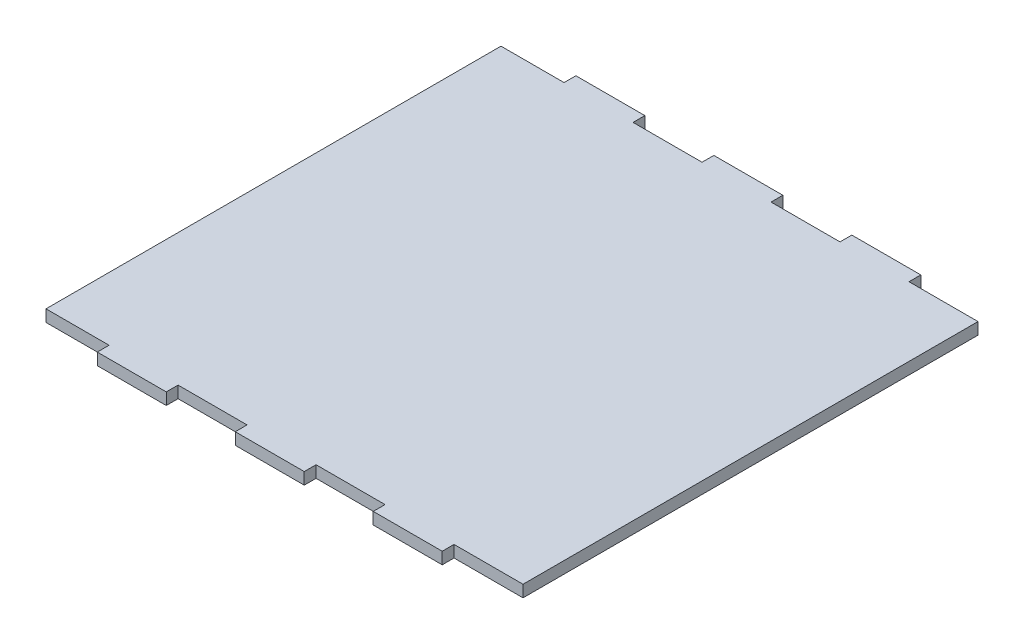
ISO-10303-21;
HEADER;
FILE_DESCRIPTION(('STEP AP214'),'2;1');
FILE_NAME('part.step','',(''),(''),'','','');
FILE_SCHEMA(('AUTOMOTIVE_DESIGN { 1 0 10303 214 1 1 1 1 }'));
ENDSEC;
DATA;
#1=APPLICATION_CONTEXT('core data for automotive mechanical design processes');
#2=APPLICATION_PROTOCOL_DEFINITION('international standard','automotive_design',2000,#1);
#3=PRODUCT_CONTEXT('',#1,'mechanical');
#4=PRODUCT('Part','Part','',(#3));
#5=PRODUCT_RELATED_PRODUCT_CATEGORY('part','',(#4));
#6=PRODUCT_DEFINITION_FORMATION('','',#4);
#7=PRODUCT_DEFINITION_CONTEXT('part definition',#1,'design');
#8=PRODUCT_DEFINITION('design','',#6,#7);
#9=PRODUCT_DEFINITION_SHAPE('','',#8);
#10=(LENGTH_UNIT() NAMED_UNIT(*) SI_UNIT(.MILLI.,.METRE.));
#11=(NAMED_UNIT(*) PLANE_ANGLE_UNIT() SI_UNIT($,.RADIAN.));
#12=(NAMED_UNIT(*) SI_UNIT($,.STERADIAN.) SOLID_ANGLE_UNIT());
#13=UNCERTAINTY_MEASURE_WITH_UNIT(LENGTH_MEASURE(1.E-05),#10,'distance_accuracy_value','');
#14=(GEOMETRIC_REPRESENTATION_CONTEXT(3) GLOBAL_UNCERTAINTY_ASSIGNED_CONTEXT((#13)) GLOBAL_UNIT_ASSIGNED_CONTEXT((#10,
#11,#12)) REPRESENTATION_CONTEXT('',''));
#15=CARTESIAN_POINT('',(0.,0.,0.));
#16=DIRECTION('',(0.,0.,1.));
#17=DIRECTION('',(1.,0.,0.));
#18=AXIS2_PLACEMENT_3D('',#15,#16,#17);
#19=CARTESIAN_POINT('',(0.,3.,0.));
#20=DIRECTION('',(0.,0.,-1.));
#21=DIRECTION('',(-1.,0.,0.));
#22=AXIS2_PLACEMENT_3D('',#19,#20,#21);
#23=PLANE('',#22);
#24=DIRECTION('',(1.,0.,0.));
#25=VECTOR('',#24,1.);
#26=CARTESIAN_POINT('',(0.,3.,0.));
#27=LINE('',#26,#25);
#28=CARTESIAN_POINT('',(1.5,3.,0.));
#29=VERTEX_POINT('',#28);
#30=CARTESIAN_POINT('',(17.52857143,3.,0.));
#31=VERTEX_POINT('',#30);
#32=EDGE_CURVE('E162',#29,#31,#27,.T.);
#33=ORIENTED_EDGE('',*,*,#32,.F.);
#34=DIRECTION('',(0.,-1.,0.));
#35=VECTOR('',#34,1.);
#36=CARTESIAN_POINT('',(1.5,3.,0.));
#37=LINE('',#36,#35);
#38=CARTESIAN_POINT('',(1.5,0.,0.));
#39=VERTEX_POINT('',#38);
#40=EDGE_CURVE('E266',#29,#39,#37,.T.);
#41=ORIENTED_EDGE('',*,*,#40,.T.);
#42=DIRECTION('',(1.,0.,0.));
#43=VECTOR('',#42,1.);
#44=CARTESIAN_POINT('',(0.,0.,0.));
#45=LINE('',#44,#43);
#46=CARTESIAN_POINT('',(17.52857143,0.,0.));
#47=VERTEX_POINT('',#46);
#48=EDGE_CURVE('E263',#39,#47,#45,.T.);
#49=ORIENTED_EDGE('',*,*,#48,.T.);
#50=DIRECTION('',(0.,-1.,0.));
#51=VECTOR('',#50,1.);
#52=CARTESIAN_POINT('',(17.52857143,3.,0.));
#53=LINE('',#52,#51);
#54=EDGE_CURVE('E11',#31,#47,#53,.T.);
#55=ORIENTED_EDGE('',*,*,#54,.F.);
#56=EDGE_LOOP('',(#33,#41,#49,#55));
#57=FACE_BOUND('',#56,.T.);
#58=ADVANCED_FACE('F44',(#57),#23,.F.);
#59=CARTESIAN_POINT('',(17.52857143,3.,0.));
#60=DIRECTION('',(1.,0.,0.));
#61=DIRECTION('',(0.,0.,-1.));
#62=AXIS2_PLACEMENT_3D('',#59,#60,#61);
#63=PLANE('',#62);
#64=DIRECTION('',(0.,0.,1.));
#65=VECTOR('',#64,1.);
#66=CARTESIAN_POINT('',(17.52857143,0.,0.));
#67=LINE('',#66,#65);
#68=CARTESIAN_POINT('',(17.52857143,0.,3.));
#69=VERTEX_POINT('',#68);
#70=EDGE_CURVE('E265',#47,#69,#67,.T.);
#71=ORIENTED_EDGE('',*,*,#70,.T.);
#72=DIRECTION('',(0.,-1.,0.));
#73=VECTOR('',#72,1.);
#74=CARTESIAN_POINT('',(17.52857143,3.,3.));
#75=LINE('',#74,#73);
#76=CARTESIAN_POINT('',(17.52857143,3.,3.));
#77=VERTEX_POINT('',#76);
#78=EDGE_CURVE('E51',#77,#69,#75,.T.);
#79=ORIENTED_EDGE('',*,*,#78,.F.);
#80=DIRECTION('',(0.,0.,1.));
#81=VECTOR('',#80,1.);
#82=CARTESIAN_POINT('',(17.52857143,3.,0.));
#83=LINE('',#82,#81);
#84=EDGE_CURVE('E473',#31,#77,#83,.T.);
#85=ORIENTED_EDGE('',*,*,#84,.F.);
#86=ORIENTED_EDGE('',*,*,#54,.T.);
#87=EDGE_LOOP('',(#71,#79,#85,#86));
#88=FACE_BOUND('',#87,.T.);
#89=ADVANCED_FACE('F474',(#88),#63,.F.);
#90=CARTESIAN_POINT('',(17.52857143,3.,3.));
#91=DIRECTION('',(0.,0.,-1.));
#92=DIRECTION('',(-1.,0.,0.));
#93=AXIS2_PLACEMENT_3D('',#90,#91,#92);
#94=PLANE('',#93);
#95=DIRECTION('',(1.,0.,0.));
#96=VECTOR('',#95,1.);
#97=CARTESIAN_POINT('',(17.52857143,0.,3.));
#98=LINE('',#97,#96);
#99=CARTESIAN_POINT('',(35.05714243,0.,3.));
#100=VERTEX_POINT('',#99);
#101=EDGE_CURVE('E268',#69,#100,#98,.T.);
#102=ORIENTED_EDGE('',*,*,#101,.T.);
#103=DIRECTION('',(0.,-1.,0.));
#104=VECTOR('',#103,1.);
#105=CARTESIAN_POINT('',(35.05714243,3.,3.));
#106=LINE('',#105,#104);
#107=CARTESIAN_POINT('',(35.05714243,3.,3.));
#108=VERTEX_POINT('',#107);
#109=EDGE_CURVE('E377',#108,#100,#106,.T.);
#110=ORIENTED_EDGE('',*,*,#109,.F.);
#111=DIRECTION('',(1.,0.,0.));
#112=VECTOR('',#111,1.);
#113=CARTESIAN_POINT('',(17.52857143,3.,3.));
#114=LINE('',#113,#112);
#115=EDGE_CURVE('E386',#77,#108,#114,.T.);
#116=ORIENTED_EDGE('',*,*,#115,.F.);
#117=ORIENTED_EDGE('',*,*,#78,.T.);
#118=EDGE_LOOP('',(#102,#110,#116,#117));
#119=FACE_BOUND('',#118,.T.);
#120=ADVANCED_FACE('F384',(#119),#94,.F.);
#121=CARTESIAN_POINT('',(35.05714243,3.,0.));
#122=DIRECTION('',(-1.,0.,0.));
#123=DIRECTION('',(0.,0.,1.));
#124=AXIS2_PLACEMENT_3D('',#121,#122,#123);
#125=PLANE('',#124);
#126=DIRECTION('',(0.,0.,-1.));
#127=VECTOR('',#126,1.);
#128=CARTESIAN_POINT('',(35.05714243,0.,0.));
#129=LINE('',#128,#127);
#130=CARTESIAN_POINT('',(35.05714243,0.,0.));
#131=VERTEX_POINT('',#130);
#132=EDGE_CURVE('E270',#100,#131,#129,.T.);
#133=ORIENTED_EDGE('',*,*,#132,.T.);
#134=DIRECTION('',(0.,-1.,0.));
#135=VECTOR('',#134,1.);
#136=CARTESIAN_POINT('',(35.05714243,3.,0.));
#137=LINE('',#136,#135);
#138=CARTESIAN_POINT('',(35.05714243,3.,0.));
#139=VERTEX_POINT('',#138);
#140=EDGE_CURVE('E374',#139,#131,#137,.T.);
#141=ORIENTED_EDGE('',*,*,#140,.F.);
#142=DIRECTION('',(0.,0.,-1.));
#143=VECTOR('',#142,1.);
#144=CARTESIAN_POINT('',(35.05714243,3.,0.));
#145=LINE('',#144,#143);
#146=EDGE_CURVE('E407',#108,#139,#145,.T.);
#147=ORIENTED_EDGE('',*,*,#146,.F.);
#148=ORIENTED_EDGE('',*,*,#109,.T.);
#149=EDGE_LOOP('',(#133,#141,#147,#148));
#150=FACE_BOUND('',#149,.T.);
#151=ADVANCED_FACE('F398',(#150),#125,.F.);
#152=CARTESIAN_POINT('',(35.05714243,3.,0.));
#153=DIRECTION('',(0.,0.,-1.));
#154=DIRECTION('',(-1.,0.,0.));
#155=AXIS2_PLACEMENT_3D('',#152,#153,#154);
#156=PLANE('',#155);
#157=DIRECTION('',(1.,0.,0.));
#158=VECTOR('',#157,1.);
#159=CARTESIAN_POINT('',(35.05714243,0.,0.));
#160=LINE('',#159,#158);
#161=CARTESIAN_POINT('',(52.58571343,0.,0.));
#162=VERTEX_POINT('',#161);
#163=EDGE_CURVE('E272',#131,#162,#160,.T.);
#164=ORIENTED_EDGE('',*,*,#163,.T.);
#165=DIRECTION('',(0.,-1.,0.));
#166=VECTOR('',#165,1.);
#167=CARTESIAN_POINT('',(52.58571343,3.,0.));
#168=LINE('',#167,#166);
#169=CARTESIAN_POINT('',(52.58571343,3.,0.));
#170=VERTEX_POINT('',#169);
#171=EDGE_CURVE('E371',#170,#162,#168,.T.);
#172=ORIENTED_EDGE('',*,*,#171,.F.);
#173=DIRECTION('',(1.,0.,0.));
#174=VECTOR('',#173,1.);
#175=CARTESIAN_POINT('',(35.05714243,3.,0.));
#176=LINE('',#175,#174);
#177=EDGE_CURVE('E404',#139,#170,#176,.T.);
#178=ORIENTED_EDGE('',*,*,#177,.F.);
#179=ORIENTED_EDGE('',*,*,#140,.T.);
#180=EDGE_LOOP('',(#164,#172,#178,#179));
#181=FACE_BOUND('',#180,.T.);
#182=ADVANCED_FACE('F402',(#181),#156,.F.);
#183=CARTESIAN_POINT('',(52.58571343,3.,0.));
#184=DIRECTION('',(1.,0.,0.));
#185=DIRECTION('',(0.,0.,-1.));
#186=AXIS2_PLACEMENT_3D('',#183,#184,#185);
#187=PLANE('',#186);
#188=DIRECTION('',(0.,0.,1.));
#189=VECTOR('',#188,1.);
#190=CARTESIAN_POINT('',(52.58571343,0.,0.));
#191=LINE('',#190,#189);
#192=CARTESIAN_POINT('',(52.58571343,0.,3.));
#193=VERTEX_POINT('',#192);
#194=EDGE_CURVE('E274',#162,#193,#191,.T.);
#195=ORIENTED_EDGE('',*,*,#194,.T.);
#196=DIRECTION('',(0.,-1.,0.));
#197=VECTOR('',#196,1.);
#198=CARTESIAN_POINT('',(52.58571343,3.,3.));
#199=LINE('',#198,#197);
#200=CARTESIAN_POINT('',(52.58571343,3.,3.));
#201=VERTEX_POINT('',#200);
#202=EDGE_CURVE('E368',#201,#193,#199,.T.);
#203=ORIENTED_EDGE('',*,*,#202,.F.);
#204=DIRECTION('',(0.,0.,1.));
#205=VECTOR('',#204,1.);
#206=CARTESIAN_POINT('',(52.58571343,3.,0.));
#207=LINE('',#206,#205);
#208=EDGE_CURVE('E406',#170,#201,#207,.T.);
#209=ORIENTED_EDGE('',*,*,#208,.F.);
#210=ORIENTED_EDGE('',*,*,#171,.T.);
#211=EDGE_LOOP('',(#195,#203,#209,#210));
#212=FACE_BOUND('',#211,.T.);
#213=ADVANCED_FACE('F486',(#212),#187,.F.);
#214=CARTESIAN_POINT('',(52.58571343,3.,3.));
#215=DIRECTION('',(0.,0.,-1.));
#216=DIRECTION('',(-1.,0.,0.));
#217=AXIS2_PLACEMENT_3D('',#214,#215,#216);
#218=PLANE('',#217);
#219=DIRECTION('',(1.,0.,0.));
#220=VECTOR('',#219,1.);
#221=CARTESIAN_POINT('',(52.58571343,0.,3.));
#222=LINE('',#221,#220);
#223=CARTESIAN_POINT('',(70.11428443,0.,3.));
#224=VERTEX_POINT('',#223);
#225=EDGE_CURVE('E276',#193,#224,#222,.T.);
#226=ORIENTED_EDGE('',*,*,#225,.T.);
#227=DIRECTION('',(0.,-1.,0.));
#228=VECTOR('',#227,1.);
#229=CARTESIAN_POINT('',(70.11428443,3.,3.));
#230=LINE('',#229,#228);
#231=CARTESIAN_POINT('',(70.11428443,3.,3.));
#232=VERTEX_POINT('',#231);
#233=EDGE_CURVE('E365',#232,#224,#230,.T.);
#234=ORIENTED_EDGE('',*,*,#233,.F.);
#235=DIRECTION('',(1.,0.,0.));
#236=VECTOR('',#235,1.);
#237=CARTESIAN_POINT('',(52.58571343,3.,3.));
#238=LINE('',#237,#236);
#239=EDGE_CURVE('E409',#201,#232,#238,.T.);
#240=ORIENTED_EDGE('',*,*,#239,.F.);
#241=ORIENTED_EDGE('',*,*,#202,.T.);
#242=EDGE_LOOP('',(#226,#234,#240,#241));
#243=FACE_BOUND('',#242,.T.);
#244=ADVANCED_FACE('F489',(#243),#218,.F.);
#245=CARTESIAN_POINT('',(70.11428443,3.,0.));
#246=DIRECTION('',(-1.,0.,0.));
#247=DIRECTION('',(0.,0.,1.));
#248=AXIS2_PLACEMENT_3D('',#245,#246,#247);
#249=PLANE('',#248);
#250=DIRECTION('',(0.,0.,-1.));
#251=VECTOR('',#250,1.);
#252=CARTESIAN_POINT('',(70.11428443,0.,0.));
#253=LINE('',#252,#251);
#254=CARTESIAN_POINT('',(70.11428443,0.,0.));
#255=VERTEX_POINT('',#254);
#256=EDGE_CURVE('E278',#224,#255,#253,.T.);
#257=ORIENTED_EDGE('',*,*,#256,.T.);
#258=DIRECTION('',(0.,-1.,0.));
#259=VECTOR('',#258,1.);
#260=CARTESIAN_POINT('',(70.11428443,3.,0.));
#261=LINE('',#260,#259);
#262=CARTESIAN_POINT('',(70.11428443,3.,0.));
#263=VERTEX_POINT('',#262);
#264=EDGE_CURVE('E362',#263,#255,#261,.T.);
#265=ORIENTED_EDGE('',*,*,#264,.F.);
#266=DIRECTION('',(0.,0.,-1.));
#267=VECTOR('',#266,1.);
#268=CARTESIAN_POINT('',(70.11428443,3.,0.));
#269=LINE('',#268,#267);
#270=EDGE_CURVE('E415',#232,#263,#269,.T.);
#271=ORIENTED_EDGE('',*,*,#270,.F.);
#272=ORIENTED_EDGE('',*,*,#233,.T.);
#273=EDGE_LOOP('',(#257,#265,#271,#272));
#274=FACE_BOUND('',#273,.T.);
#275=ADVANCED_FACE('F493',(#274),#249,.F.);
#276=CARTESIAN_POINT('',(70.11428443,3.,0.));
#277=DIRECTION('',(0.,0.,-1.));
#278=DIRECTION('',(-1.,0.,0.));
#279=AXIS2_PLACEMENT_3D('',#276,#277,#278);
#280=PLANE('',#279);
#281=DIRECTION('',(1.,0.,0.));
#282=VECTOR('',#281,1.);
#283=CARTESIAN_POINT('',(70.11428443,0.,0.));
#284=LINE('',#283,#282);
#285=CARTESIAN_POINT('',(87.64285543,0.,0.));
#286=VERTEX_POINT('',#285);
#287=EDGE_CURVE('E280',#255,#286,#284,.T.);
#288=ORIENTED_EDGE('',*,*,#287,.T.);
#289=DIRECTION('',(0.,-1.,0.));
#290=VECTOR('',#289,1.);
#291=CARTESIAN_POINT('',(87.64285543,3.,0.));
#292=LINE('',#291,#290);
#293=CARTESIAN_POINT('',(87.64285543,3.,0.));
#294=VERTEX_POINT('',#293);
#295=EDGE_CURVE('E359',#294,#286,#292,.T.);
#296=ORIENTED_EDGE('',*,*,#295,.F.);
#297=DIRECTION('',(1.,0.,0.));
#298=VECTOR('',#297,1.);
#299=CARTESIAN_POINT('',(70.11428443,3.,0.));
#300=LINE('',#299,#298);
#301=EDGE_CURVE('E417',#263,#294,#300,.T.);
#302=ORIENTED_EDGE('',*,*,#301,.F.);
#303=ORIENTED_EDGE('',*,*,#264,.T.);
#304=EDGE_LOOP('',(#288,#296,#302,#303));
#305=FACE_BOUND('',#304,.T.);
#306=ADVANCED_FACE('F497',(#305),#280,.F.);
#307=CARTESIAN_POINT('',(87.64285543,3.,0.));
#308=DIRECTION('',(1.,0.,0.));
#309=DIRECTION('',(0.,0.,-1.));
#310=AXIS2_PLACEMENT_3D('',#307,#308,#309);
#311=PLANE('',#310);
#312=DIRECTION('',(0.,0.,1.));
#313=VECTOR('',#312,1.);
#314=CARTESIAN_POINT('',(87.64285543,0.,0.));
#315=LINE('',#314,#313);
#316=CARTESIAN_POINT('',(87.64285543,0.,3.));
#317=VERTEX_POINT('',#316);
#318=EDGE_CURVE('E282',#286,#317,#315,.T.);
#319=ORIENTED_EDGE('',*,*,#318,.T.);
#320=DIRECTION('',(0.,-1.,0.));
#321=VECTOR('',#320,1.);
#322=CARTESIAN_POINT('',(87.64285543,3.,3.));
#323=LINE('',#322,#321);
#324=CARTESIAN_POINT('',(87.64285543,3.,3.));
#325=VERTEX_POINT('',#324);
#326=EDGE_CURVE('E356',#325,#317,#323,.T.);
#327=ORIENTED_EDGE('',*,*,#326,.F.);
#328=DIRECTION('',(0.,0.,1.));
#329=VECTOR('',#328,1.);
#330=CARTESIAN_POINT('',(87.64285543,3.,0.));
#331=LINE('',#330,#329);
#332=EDGE_CURVE('E419',#294,#325,#331,.T.);
#333=ORIENTED_EDGE('',*,*,#332,.F.);
#334=ORIENTED_EDGE('',*,*,#295,.T.);
#335=EDGE_LOOP('',(#319,#327,#333,#334));
#336=FACE_BOUND('',#335,.T.);
#337=ADVANCED_FACE('F501',(#336),#311,.F.);
#338=CARTESIAN_POINT('',(87.64285543,3.,3.));
#339=DIRECTION('',(0.,0.,-1.));
#340=DIRECTION('',(-1.,0.,0.));
#341=AXIS2_PLACEMENT_3D('',#338,#339,#340);
#342=PLANE('',#341);
#343=DIRECTION('',(1.,0.,0.));
#344=VECTOR('',#343,1.);
#345=CARTESIAN_POINT('',(87.64285543,0.,3.));
#346=LINE('',#345,#344);
#347=CARTESIAN_POINT('',(105.17142643,0.,3.));
#348=VERTEX_POINT('',#347);
#349=EDGE_CURVE('E284',#317,#348,#346,.T.);
#350=ORIENTED_EDGE('',*,*,#349,.T.);
#351=DIRECTION('',(0.,-1.,0.));
#352=VECTOR('',#351,1.);
#353=CARTESIAN_POINT('',(105.17142643,3.,3.));
#354=LINE('',#353,#352);
#355=CARTESIAN_POINT('',(105.17142643,3.,3.));
#356=VERTEX_POINT('',#355);
#357=EDGE_CURVE('E353',#356,#348,#354,.T.);
#358=ORIENTED_EDGE('',*,*,#357,.F.);
#359=DIRECTION('',(1.,0.,0.));
#360=VECTOR('',#359,1.);
#361=CARTESIAN_POINT('',(87.64285543,3.,3.));
#362=LINE('',#361,#360);
#363=EDGE_CURVE('E421',#325,#356,#362,.T.);
#364=ORIENTED_EDGE('',*,*,#363,.F.);
#365=ORIENTED_EDGE('',*,*,#326,.T.);
#366=EDGE_LOOP('',(#350,#358,#364,#365));
#367=FACE_BOUND('',#366,.T.);
#368=ADVANCED_FACE('F505',(#367),#342,.F.);
#369=CARTESIAN_POINT('',(105.17142643,3.,0.));
#370=DIRECTION('',(-1.,0.,0.));
#371=DIRECTION('',(0.,0.,1.));
#372=AXIS2_PLACEMENT_3D('',#369,#370,#371);
#373=PLANE('',#372);
#374=DIRECTION('',(0.,0.,-1.));
#375=VECTOR('',#374,1.);
#376=CARTESIAN_POINT('',(105.17142643,0.,0.));
#377=LINE('',#376,#375);
#378=CARTESIAN_POINT('',(105.17142643,0.,0.));
#379=VERTEX_POINT('',#378);
#380=EDGE_CURVE('E286',#348,#379,#377,.T.);
#381=ORIENTED_EDGE('',*,*,#380,.T.);
#382=DIRECTION('',(0.,-1.,0.));
#383=VECTOR('',#382,1.);
#384=CARTESIAN_POINT('',(105.17142643,3.,0.));
#385=LINE('',#384,#383);
#386=CARTESIAN_POINT('',(105.17142643,3.,0.));
#387=VERTEX_POINT('',#386);
#388=EDGE_CURVE('E350',#387,#379,#385,.T.);
#389=ORIENTED_EDGE('',*,*,#388,.F.);
#390=DIRECTION('',(0.,0.,-1.));
#391=VECTOR('',#390,1.);
#392=CARTESIAN_POINT('',(105.17142643,3.,0.));
#393=LINE('',#392,#391);
#394=EDGE_CURVE('E423',#356,#387,#393,.T.);
#395=ORIENTED_EDGE('',*,*,#394,.F.);
#396=ORIENTED_EDGE('',*,*,#357,.T.);
#397=EDGE_LOOP('',(#381,#389,#395,#396));
#398=FACE_BOUND('',#397,.T.);
#399=ADVANCED_FACE('F509',(#398),#373,.F.);
#400=CARTESIAN_POINT('',(105.17142643,3.,0.));
#401=DIRECTION('',(0.,0.,-1.));
#402=DIRECTION('',(-1.,0.,0.));
#403=AXIS2_PLACEMENT_3D('',#400,#401,#402);
#404=PLANE('',#403);
#405=DIRECTION('',(1.,0.,0.));
#406=VECTOR('',#405,1.);
#407=CARTESIAN_POINT('',(105.17142643,0.,0.));
#408=LINE('',#407,#406);
#409=CARTESIAN_POINT('',(122.7,0.,0.));
#410=VERTEX_POINT('',#409);
#411=EDGE_CURVE('E288',#379,#410,#408,.T.);
#412=ORIENTED_EDGE('',*,*,#411,.T.);
#413=DIRECTION('',(0.,-1.,0.));
#414=VECTOR('',#413,1.);
#415=CARTESIAN_POINT('',(122.7,3.,0.));
#416=LINE('',#415,#414);
#417=CARTESIAN_POINT('',(122.7,3.,0.));
#418=VERTEX_POINT('',#417);
#419=EDGE_CURVE('E347',#418,#410,#416,.T.);
#420=ORIENTED_EDGE('',*,*,#419,.F.);
#421=DIRECTION('',(1.,0.,0.));
#422=VECTOR('',#421,1.);
#423=CARTESIAN_POINT('',(105.17142643,3.,0.));
#424=LINE('',#423,#422);
#425=EDGE_CURVE('E425',#387,#418,#424,.T.);
#426=ORIENTED_EDGE('',*,*,#425,.F.);
#427=ORIENTED_EDGE('',*,*,#388,.T.);
#428=EDGE_LOOP('',(#412,#420,#426,#427));
#429=FACE_BOUND('',#428,.T.);
#430=ADVANCED_FACE('F513',(#429),#404,.F.);
#431=CARTESIAN_POINT('',(122.7,3.,0.));
#432=DIRECTION('',(-1.,0.,0.));
#433=DIRECTION('',(0.,0.,1.));
#434=AXIS2_PLACEMENT_3D('',#431,#432,#433);
#435=PLANE('',#434);
#436=DIRECTION('',(0.,0.,-1.));
#437=VECTOR('',#436,1.);
#438=CARTESIAN_POINT('',(122.7,0.,0.));
#439=LINE('',#438,#437);
#440=CARTESIAN_POINT('',(122.7,0.,-115.6));
#441=VERTEX_POINT('',#440);
#442=EDGE_CURVE('E290',#410,#441,#439,.T.);
#443=ORIENTED_EDGE('',*,*,#442,.T.);
#444=DIRECTION('',(0.,-1.,0.));
#445=VECTOR('',#444,1.);
#446=CARTESIAN_POINT('',(122.7,3.,-115.6));
#447=LINE('',#446,#445);
#448=CARTESIAN_POINT('',(122.7,3.,-115.6));
#449=VERTEX_POINT('',#448);
#450=EDGE_CURVE('E344',#449,#441,#447,.T.);
#451=ORIENTED_EDGE('',*,*,#450,.F.);
#452=DIRECTION('',(0.,0.,-1.));
#453=VECTOR('',#452,1.);
#454=CARTESIAN_POINT('',(122.7,3.,0.));
#455=LINE('',#454,#453);
#456=EDGE_CURVE('E427',#418,#449,#455,.T.);
#457=ORIENTED_EDGE('',*,*,#456,.F.);
#458=ORIENTED_EDGE('',*,*,#419,.T.);
#459=EDGE_LOOP('',(#443,#451,#457,#458));
#460=FACE_BOUND('',#459,.T.);
#461=ADVANCED_FACE('F517',(#460),#435,.F.);
#462=CARTESIAN_POINT('',(105.17142643,3.,-115.6));
#463=DIRECTION('',(0.,0.,1.));
#464=DIRECTION('',(1.,0.,0.));
#465=AXIS2_PLACEMENT_3D('',#462,#463,#464);
#466=PLANE('',#465);
#467=DIRECTION('',(-1.,0.,0.));
#468=VECTOR('',#467,1.);
#469=CARTESIAN_POINT('',(105.17142643,0.,-115.6));
#470=LINE('',#469,#468);
#471=CARTESIAN_POINT('',(105.17142643,0.,-115.6));
#472=VERTEX_POINT('',#471);
#473=EDGE_CURVE('E292',#441,#472,#470,.T.);
#474=ORIENTED_EDGE('',*,*,#473,.T.);
#475=DIRECTION('',(0.,-1.,0.));
#476=VECTOR('',#475,1.);
#477=CARTESIAN_POINT('',(105.17142643,3.,-115.6));
#478=LINE('',#477,#476);
#479=CARTESIAN_POINT('',(105.17142643,3.,-115.6));
#480=VERTEX_POINT('',#479);
#481=EDGE_CURVE('E341',#480,#472,#478,.T.);
#482=ORIENTED_EDGE('',*,*,#481,.F.);
#483=DIRECTION('',(-1.,0.,0.));
#484=VECTOR('',#483,1.);
#485=CARTESIAN_POINT('',(105.17142643,3.,-115.6));
#486=LINE('',#485,#484);
#487=EDGE_CURVE('E429',#449,#480,#486,.T.);
#488=ORIENTED_EDGE('',*,*,#487,.F.);
#489=ORIENTED_EDGE('',*,*,#450,.T.);
#490=EDGE_LOOP('',(#474,#482,#488,#489));
#491=FACE_BOUND('',#490,.T.);
#492=ADVANCED_FACE('F521',(#491),#466,.F.);
#493=CARTESIAN_POINT('',(105.17142643,3.,-115.6));
#494=DIRECTION('',(-1.,0.,0.));
#495=DIRECTION('',(0.,0.,1.));
#496=AXIS2_PLACEMENT_3D('',#493,#494,#495);
#497=PLANE('',#496);
#498=DIRECTION('',(0.,0.,-1.));
#499=VECTOR('',#498,1.);
#500=CARTESIAN_POINT('',(105.17142643,0.,-115.6));
#501=LINE('',#500,#499);
#502=CARTESIAN_POINT('',(105.17142643,0.,-118.6));
#503=VERTEX_POINT('',#502);
#504=EDGE_CURVE('E294',#472,#503,#501,.T.);
#505=ORIENTED_EDGE('',*,*,#504,.T.);
#506=DIRECTION('',(0.,-1.,0.));
#507=VECTOR('',#506,1.);
#508=CARTESIAN_POINT('',(105.17142643,3.,-118.6));
#509=LINE('',#508,#507);
#510=CARTESIAN_POINT('',(105.17142643,3.,-118.6));
#511=VERTEX_POINT('',#510);
#512=EDGE_CURVE('E338',#511,#503,#509,.T.);
#513=ORIENTED_EDGE('',*,*,#512,.F.);
#514=DIRECTION('',(0.,0.,-1.));
#515=VECTOR('',#514,1.);
#516=CARTESIAN_POINT('',(105.17142643,3.,-115.6));
#517=LINE('',#516,#515);
#518=EDGE_CURVE('E431',#480,#511,#517,.T.);
#519=ORIENTED_EDGE('',*,*,#518,.F.);
#520=ORIENTED_EDGE('',*,*,#481,.T.);
#521=EDGE_LOOP('',(#505,#513,#519,#520));
#522=FACE_BOUND('',#521,.T.);
#523=ADVANCED_FACE('F525',(#522),#497,.F.);
#524=CARTESIAN_POINT('',(87.64285543,3.,-118.6));
#525=DIRECTION('',(0.,0.,1.));
#526=DIRECTION('',(1.,0.,0.));
#527=AXIS2_PLACEMENT_3D('',#524,#525,#526);
#528=PLANE('',#527);
#529=DIRECTION('',(-1.,0.,0.));
#530=VECTOR('',#529,1.);
#531=CARTESIAN_POINT('',(87.64285543,0.,-118.6));
#532=LINE('',#531,#530);
#533=CARTESIAN_POINT('',(87.64285543,0.,-118.6));
#534=VERTEX_POINT('',#533);
#535=EDGE_CURVE('E296',#503,#534,#532,.T.);
#536=ORIENTED_EDGE('',*,*,#535,.T.);
#537=DIRECTION('',(0.,-1.,0.));
#538=VECTOR('',#537,1.);
#539=CARTESIAN_POINT('',(87.64285543,3.,-118.6));
#540=LINE('',#539,#538);
#541=CARTESIAN_POINT('',(87.64285543,3.,-118.6));
#542=VERTEX_POINT('',#541);
#543=EDGE_CURVE('E335',#542,#534,#540,.T.);
#544=ORIENTED_EDGE('',*,*,#543,.F.);
#545=DIRECTION('',(-1.,0.,0.));
#546=VECTOR('',#545,1.);
#547=CARTESIAN_POINT('',(87.64285543,3.,-118.6));
#548=LINE('',#547,#546);
#549=EDGE_CURVE('E433',#511,#542,#548,.T.);
#550=ORIENTED_EDGE('',*,*,#549,.F.);
#551=ORIENTED_EDGE('',*,*,#512,.T.);
#552=EDGE_LOOP('',(#536,#544,#550,#551));
#553=FACE_BOUND('',#552,.T.);
#554=ADVANCED_FACE('F529',(#553),#528,.F.);
#555=CARTESIAN_POINT('',(87.64285543,3.,-115.6));
#556=DIRECTION('',(1.,0.,0.));
#557=DIRECTION('',(0.,0.,-1.));
#558=AXIS2_PLACEMENT_3D('',#555,#556,#557);
#559=PLANE('',#558);
#560=DIRECTION('',(0.,0.,1.));
#561=VECTOR('',#560,1.);
#562=CARTESIAN_POINT('',(87.64285543,0.,-115.6));
#563=LINE('',#562,#561);
#564=CARTESIAN_POINT('',(87.64285543,0.,-115.6));
#565=VERTEX_POINT('',#564);
#566=EDGE_CURVE('E298',#534,#565,#563,.T.);
#567=ORIENTED_EDGE('',*,*,#566,.T.);
#568=DIRECTION('',(0.,-1.,0.));
#569=VECTOR('',#568,1.);
#570=CARTESIAN_POINT('',(87.64285543,3.,-115.6));
#571=LINE('',#570,#569);
#572=CARTESIAN_POINT('',(87.64285543,3.,-115.6));
#573=VERTEX_POINT('',#572);
#574=EDGE_CURVE('E332',#573,#565,#571,.T.);
#575=ORIENTED_EDGE('',*,*,#574,.F.);
#576=DIRECTION('',(0.,0.,1.));
#577=VECTOR('',#576,1.);
#578=CARTESIAN_POINT('',(87.64285543,3.,-115.6));
#579=LINE('',#578,#577);
#580=EDGE_CURVE('E435',#542,#573,#579,.T.);
#581=ORIENTED_EDGE('',*,*,#580,.F.);
#582=ORIENTED_EDGE('',*,*,#543,.T.);
#583=EDGE_LOOP('',(#567,#575,#581,#582));
#584=FACE_BOUND('',#583,.T.);
#585=ADVANCED_FACE('F533',(#584),#559,.F.);
#586=CARTESIAN_POINT('',(70.11428443,3.,-115.6));
#587=DIRECTION('',(0.,0.,1.));
#588=DIRECTION('',(1.,0.,0.));
#589=AXIS2_PLACEMENT_3D('',#586,#587,#588);
#590=PLANE('',#589);
#591=DIRECTION('',(-1.,0.,0.));
#592=VECTOR('',#591,1.);
#593=CARTESIAN_POINT('',(70.11428443,0.,-115.6));
#594=LINE('',#593,#592);
#595=CARTESIAN_POINT('',(70.11428443,0.,-115.6));
#596=VERTEX_POINT('',#595);
#597=EDGE_CURVE('E300',#565,#596,#594,.T.);
#598=ORIENTED_EDGE('',*,*,#597,.T.);
#599=DIRECTION('',(0.,-1.,0.));
#600=VECTOR('',#599,1.);
#601=CARTESIAN_POINT('',(70.11428443,3.,-115.6));
#602=LINE('',#601,#600);
#603=CARTESIAN_POINT('',(70.11428443,3.,-115.6));
#604=VERTEX_POINT('',#603);
#605=EDGE_CURVE('E329',#604,#596,#602,.T.);
#606=ORIENTED_EDGE('',*,*,#605,.F.);
#607=DIRECTION('',(-1.,0.,0.));
#608=VECTOR('',#607,1.);
#609=CARTESIAN_POINT('',(70.11428443,3.,-115.6));
#610=LINE('',#609,#608);
#611=EDGE_CURVE('E437',#573,#604,#610,.T.);
#612=ORIENTED_EDGE('',*,*,#611,.F.);
#613=ORIENTED_EDGE('',*,*,#574,.T.);
#614=EDGE_LOOP('',(#598,#606,#612,#613));
#615=FACE_BOUND('',#614,.T.);
#616=ADVANCED_FACE('F537',(#615),#590,.F.);
#617=CARTESIAN_POINT('',(70.11428443,3.,-115.6));
#618=DIRECTION('',(-1.,0.,0.));
#619=DIRECTION('',(0.,0.,1.));
#620=AXIS2_PLACEMENT_3D('',#617,#618,#619);
#621=PLANE('',#620);
#622=DIRECTION('',(0.,0.,-1.));
#623=VECTOR('',#622,1.);
#624=CARTESIAN_POINT('',(70.11428443,0.,-115.6));
#625=LINE('',#624,#623);
#626=CARTESIAN_POINT('',(70.11428443,0.,-118.6));
#627=VERTEX_POINT('',#626);
#628=EDGE_CURVE('E302',#596,#627,#625,.T.);
#629=ORIENTED_EDGE('',*,*,#628,.T.);
#630=DIRECTION('',(0.,-1.,0.));
#631=VECTOR('',#630,1.);
#632=CARTESIAN_POINT('',(70.11428443,3.,-118.6));
#633=LINE('',#632,#631);
#634=CARTESIAN_POINT('',(70.11428443,3.,-118.6));
#635=VERTEX_POINT('',#634);
#636=EDGE_CURVE('E326',#635,#627,#633,.T.);
#637=ORIENTED_EDGE('',*,*,#636,.F.);
#638=DIRECTION('',(0.,0.,-1.));
#639=VECTOR('',#638,1.);
#640=CARTESIAN_POINT('',(70.11428443,3.,-115.6));
#641=LINE('',#640,#639);
#642=EDGE_CURVE('E439',#604,#635,#641,.T.);
#643=ORIENTED_EDGE('',*,*,#642,.F.);
#644=ORIENTED_EDGE('',*,*,#605,.T.);
#645=EDGE_LOOP('',(#629,#637,#643,#644));
#646=FACE_BOUND('',#645,.T.);
#647=ADVANCED_FACE('F541',(#646),#621,.F.);
#648=CARTESIAN_POINT('',(52.58571343,3.,-118.6));
#649=DIRECTION('',(0.,0.,1.));
#650=DIRECTION('',(1.,0.,0.));
#651=AXIS2_PLACEMENT_3D('',#648,#649,#650);
#652=PLANE('',#651);
#653=DIRECTION('',(-1.,0.,0.));
#654=VECTOR('',#653,1.);
#655=CARTESIAN_POINT('',(52.58571343,0.,-118.6));
#656=LINE('',#655,#654);
#657=CARTESIAN_POINT('',(52.58571343,0.,-118.6));
#658=VERTEX_POINT('',#657);
#659=EDGE_CURVE('E304',#627,#658,#656,.T.);
#660=ORIENTED_EDGE('',*,*,#659,.T.);
#661=DIRECTION('',(0.,-1.,0.));
#662=VECTOR('',#661,1.);
#663=CARTESIAN_POINT('',(52.58571343,3.,-118.6));
#664=LINE('',#663,#662);
#665=CARTESIAN_POINT('',(52.58571343,3.,-118.6));
#666=VERTEX_POINT('',#665);
#667=EDGE_CURVE('E323',#666,#658,#664,.T.);
#668=ORIENTED_EDGE('',*,*,#667,.F.);
#669=DIRECTION('',(-1.,0.,0.));
#670=VECTOR('',#669,1.);
#671=CARTESIAN_POINT('',(52.58571343,3.,-118.6));
#672=LINE('',#671,#670);
#673=EDGE_CURVE('E441',#635,#666,#672,.T.);
#674=ORIENTED_EDGE('',*,*,#673,.F.);
#675=ORIENTED_EDGE('',*,*,#636,.T.);
#676=EDGE_LOOP('',(#660,#668,#674,#675));
#677=FACE_BOUND('',#676,.T.);
#678=ADVANCED_FACE('F545',(#677),#652,.F.);
#679=CARTESIAN_POINT('',(52.58571343,3.,-115.6));
#680=DIRECTION('',(1.,0.,0.));
#681=DIRECTION('',(0.,0.,-1.));
#682=AXIS2_PLACEMENT_3D('',#679,#680,#681);
#683=PLANE('',#682);
#684=DIRECTION('',(0.,0.,1.));
#685=VECTOR('',#684,1.);
#686=CARTESIAN_POINT('',(52.58571343,0.,-115.6));
#687=LINE('',#686,#685);
#688=CARTESIAN_POINT('',(52.58571343,0.,-115.6));
#689=VERTEX_POINT('',#688);
#690=EDGE_CURVE('E306',#658,#689,#687,.T.);
#691=ORIENTED_EDGE('',*,*,#690,.T.);
#692=DIRECTION('',(0.,-1.,0.));
#693=VECTOR('',#692,1.);
#694=CARTESIAN_POINT('',(52.58571343,3.,-115.6));
#695=LINE('',#694,#693);
#696=CARTESIAN_POINT('',(52.58571343,3.,-115.6));
#697=VERTEX_POINT('',#696);
#698=EDGE_CURVE('E320',#697,#689,#695,.T.);
#699=ORIENTED_EDGE('',*,*,#698,.F.);
#700=DIRECTION('',(0.,0.,1.));
#701=VECTOR('',#700,1.);
#702=CARTESIAN_POINT('',(52.58571343,3.,-115.6));
#703=LINE('',#702,#701);
#704=EDGE_CURVE('E443',#666,#697,#703,.T.);
#705=ORIENTED_EDGE('',*,*,#704,.F.);
#706=ORIENTED_EDGE('',*,*,#667,.T.);
#707=EDGE_LOOP('',(#691,#699,#705,#706));
#708=FACE_BOUND('',#707,.T.);
#709=ADVANCED_FACE('F449',(#708),#683,.F.);
#710=CARTESIAN_POINT('',(35.05714243,3.,-115.6));
#711=DIRECTION('',(0.,0.,1.));
#712=DIRECTION('',(1.,0.,0.));
#713=AXIS2_PLACEMENT_3D('',#710,#711,#712);
#714=PLANE('',#713);
#715=DIRECTION('',(-1.,0.,0.));
#716=VECTOR('',#715,1.);
#717=CARTESIAN_POINT('',(35.05714243,0.,-115.6));
#718=LINE('',#717,#716);
#719=CARTESIAN_POINT('',(35.05714243,0.,-115.6));
#720=VERTEX_POINT('',#719);
#721=EDGE_CURVE('E308',#689,#720,#718,.T.);
#722=ORIENTED_EDGE('',*,*,#721,.T.);
#723=DIRECTION('',(0.,-1.,0.));
#724=VECTOR('',#723,1.);
#725=CARTESIAN_POINT('',(35.05714243,3.,-115.6));
#726=LINE('',#725,#724);
#727=CARTESIAN_POINT('',(35.05714243,3.,-115.6));
#728=VERTEX_POINT('',#727);
#729=EDGE_CURVE('E252',#728,#720,#726,.T.);
#730=ORIENTED_EDGE('',*,*,#729,.F.);
#731=DIRECTION('',(-1.,0.,0.));
#732=VECTOR('',#731,1.);
#733=CARTESIAN_POINT('',(35.05714243,3.,-115.6));
#734=LINE('',#733,#732);
#735=EDGE_CURVE('E240',#697,#728,#734,.T.);
#736=ORIENTED_EDGE('',*,*,#735,.F.);
#737=ORIENTED_EDGE('',*,*,#698,.T.);
#738=EDGE_LOOP('',(#722,#730,#736,#737));
#739=FACE_BOUND('',#738,.T.);
#740=ADVANCED_FACE('F453',(#739),#714,.F.);
#741=CARTESIAN_POINT('',(35.05714243,3.,-115.6));
#742=DIRECTION('',(-1.,0.,0.));
#743=DIRECTION('',(0.,0.,1.));
#744=AXIS2_PLACEMENT_3D('',#741,#742,#743);
#745=PLANE('',#744);
#746=DIRECTION('',(0.,0.,-1.));
#747=VECTOR('',#746,1.);
#748=CARTESIAN_POINT('',(35.05714243,0.,-115.6));
#749=LINE('',#748,#747);
#750=CARTESIAN_POINT('',(35.05714243,0.,-118.6));
#751=VERTEX_POINT('',#750);
#752=EDGE_CURVE('E249',#720,#751,#749,.T.);
#753=ORIENTED_EDGE('',*,*,#752,.T.);
#754=DIRECTION('',(0.,-1.,0.));
#755=VECTOR('',#754,1.);
#756=CARTESIAN_POINT('',(35.05714243,3.,-118.6));
#757=LINE('',#756,#755);
#758=CARTESIAN_POINT('',(35.05714243,3.,-118.6));
#759=VERTEX_POINT('',#758);
#760=EDGE_CURVE('E246',#759,#751,#757,.T.);
#761=ORIENTED_EDGE('',*,*,#760,.F.);
#762=DIRECTION('',(0.,0.,-1.));
#763=VECTOR('',#762,1.);
#764=CARTESIAN_POINT('',(35.05714243,3.,-115.6));
#765=LINE('',#764,#763);
#766=EDGE_CURVE('E233',#728,#759,#765,.T.);
#767=ORIENTED_EDGE('',*,*,#766,.F.);
#768=ORIENTED_EDGE('',*,*,#729,.T.);
#769=EDGE_LOOP('',(#753,#761,#767,#768));
#770=FACE_BOUND('',#769,.T.);
#771=ADVANCED_FACE('F247',(#770),#745,.F.);
#772=CARTESIAN_POINT('',(17.52857143,3.,-118.6));
#773=DIRECTION('',(0.,0.,1.));
#774=DIRECTION('',(1.,0.,0.));
#775=AXIS2_PLACEMENT_3D('',#772,#773,#774);
#776=PLANE('',#775);
#777=DIRECTION('',(-1.,0.,0.));
#778=VECTOR('',#777,1.);
#779=CARTESIAN_POINT('',(17.52857143,0.,-118.6));
#780=LINE('',#779,#778);
#781=CARTESIAN_POINT('',(17.52857143,0.,-118.6));
#782=VERTEX_POINT('',#781);
#783=EDGE_CURVE('E311',#751,#782,#780,.T.);
#784=ORIENTED_EDGE('',*,*,#783,.T.);
#785=DIRECTION('',(0.,-1.,0.));
#786=VECTOR('',#785,1.);
#787=CARTESIAN_POINT('',(17.52857143,3.,-118.6));
#788=LINE('',#787,#786);
#789=CARTESIAN_POINT('',(17.52857143,3.,-118.6));
#790=VERTEX_POINT('',#789);
#791=EDGE_CURVE('E253',#790,#782,#788,.T.);
#792=ORIENTED_EDGE('',*,*,#791,.F.);
#793=DIRECTION('',(-1.,0.,0.));
#794=VECTOR('',#793,1.);
#795=CARTESIAN_POINT('',(17.52857143,3.,-118.6));
#796=LINE('',#795,#794);
#797=EDGE_CURVE('E237',#759,#790,#796,.T.);
#798=ORIENTED_EDGE('',*,*,#797,.F.);
#799=ORIENTED_EDGE('',*,*,#760,.T.);
#800=EDGE_LOOP('',(#784,#792,#798,#799));
#801=FACE_BOUND('',#800,.T.);
#802=ADVANCED_FACE('F255',(#801),#776,.F.);
#803=CARTESIAN_POINT('',(17.52857143,3.,-115.6));
#804=DIRECTION('',(1.,0.,0.));
#805=DIRECTION('',(0.,0.,-1.));
#806=AXIS2_PLACEMENT_3D('',#803,#804,#805);
#807=PLANE('',#806);
#808=DIRECTION('',(0.,0.,1.));
#809=VECTOR('',#808,1.);
#810=CARTESIAN_POINT('',(17.52857143,0.,-115.6));
#811=LINE('',#810,#809);
#812=CARTESIAN_POINT('',(17.52857143,0.,-115.6));
#813=VERTEX_POINT('',#812);
#814=EDGE_CURVE('E154',#782,#813,#811,.T.);
#815=ORIENTED_EDGE('',*,*,#814,.T.);
#816=DIRECTION('',(0.,-1.,0.));
#817=VECTOR('',#816,1.);
#818=CARTESIAN_POINT('',(17.52857143,3.,-115.6));
#819=LINE('',#818,#817);
#820=CARTESIAN_POINT('',(17.52857143,3.,-115.6));
#821=VERTEX_POINT('',#820);
#822=EDGE_CURVE('E262',#821,#813,#819,.T.);
#823=ORIENTED_EDGE('',*,*,#822,.F.);
#824=DIRECTION('',(0.,0.,1.));
#825=VECTOR('',#824,1.);
#826=CARTESIAN_POINT('',(17.52857143,3.,-115.6));
#827=LINE('',#826,#825);
#828=EDGE_CURVE('E67',#790,#821,#827,.T.);
#829=ORIENTED_EDGE('',*,*,#828,.F.);
#830=ORIENTED_EDGE('',*,*,#791,.T.);
#831=EDGE_LOOP('',(#815,#823,#829,#830));
#832=FACE_BOUND('',#831,.T.);
#833=ADVANCED_FACE('F455',(#832),#807,.F.);
#834=CARTESIAN_POINT('',(0.,3.,-115.6));
#835=DIRECTION('',(0.,0.,1.));
#836=DIRECTION('',(1.,0.,0.));
#837=AXIS2_PLACEMENT_3D('',#834,#835,#836);
#838=PLANE('',#837);
#839=DIRECTION('',(-1.,0.,0.));
#840=VECTOR('',#839,1.);
#841=CARTESIAN_POINT('',(0.,0.,-115.6));
#842=LINE('',#841,#840);
#843=CARTESIAN_POINT('',(1.50000000000001,0.,-115.6));
#844=VERTEX_POINT('',#843);
#845=EDGE_CURVE('E314',#813,#844,#842,.T.);
#846=ORIENTED_EDGE('',*,*,#845,.T.);
#847=DIRECTION('',(0.,-1.,0.));
#848=VECTOR('',#847,1.);
#849=CARTESIAN_POINT('',(1.50000000000001,3.,-115.6));
#850=LINE('',#849,#848);
#851=CARTESIAN_POINT('',(1.50000000000001,3.,-115.6));
#852=VERTEX_POINT('',#851);
#853=EDGE_CURVE('E58',#852,#844,#850,.T.);
#854=ORIENTED_EDGE('',*,*,#853,.F.);
#855=DIRECTION('',(-1.,0.,0.));
#856=VECTOR('',#855,1.);
#857=CARTESIAN_POINT('',(0.,3.,-115.6));
#858=LINE('',#857,#856);
#859=EDGE_CURVE('E257',#821,#852,#858,.T.);
#860=ORIENTED_EDGE('',*,*,#859,.F.);
#861=ORIENTED_EDGE('',*,*,#822,.T.);
#862=EDGE_LOOP('',(#846,#854,#860,#861));
#863=FACE_BOUND('',#862,.T.);
#864=ADVANCED_FACE('F458',(#863),#838,.F.);
#865=CARTESIAN_POINT('',(0.,3.,0.));
#866=DIRECTION('',(0.,-1.,0.));
#867=DIRECTION('',(0.,0.,-1.));
#868=AXIS2_PLACEMENT_3D('',#865,#866,#867);
#869=PLANE('',#868);
#870=ORIENTED_EDGE('',*,*,#859,.T.);
#871=DIRECTION('',(0.,0.,1.));
#872=VECTOR('',#871,1.);
#873=CARTESIAN_POINT('',(1.5,3.,0.));
#874=LINE('',#873,#872);
#875=EDGE_CURVE('E460',#852,#29,#874,.T.);
#876=ORIENTED_EDGE('',*,*,#875,.T.);
#877=ORIENTED_EDGE('',*,*,#32,.T.);
#878=ORIENTED_EDGE('',*,*,#84,.T.);
#879=ORIENTED_EDGE('',*,*,#115,.T.);
#880=ORIENTED_EDGE('',*,*,#146,.T.);
#881=ORIENTED_EDGE('',*,*,#177,.T.);
#882=ORIENTED_EDGE('',*,*,#208,.T.);
#883=ORIENTED_EDGE('',*,*,#239,.T.);
#884=ORIENTED_EDGE('',*,*,#270,.T.);
#885=ORIENTED_EDGE('',*,*,#301,.T.);
#886=ORIENTED_EDGE('',*,*,#332,.T.);
#887=ORIENTED_EDGE('',*,*,#363,.T.);
#888=ORIENTED_EDGE('',*,*,#394,.T.);
#889=ORIENTED_EDGE('',*,*,#425,.T.);
#890=ORIENTED_EDGE('',*,*,#456,.T.);
#891=ORIENTED_EDGE('',*,*,#487,.T.);
#892=ORIENTED_EDGE('',*,*,#518,.T.);
#893=ORIENTED_EDGE('',*,*,#549,.T.);
#894=ORIENTED_EDGE('',*,*,#580,.T.);
#895=ORIENTED_EDGE('',*,*,#611,.T.);
#896=ORIENTED_EDGE('',*,*,#642,.T.);
#897=ORIENTED_EDGE('',*,*,#673,.T.);
#898=ORIENTED_EDGE('',*,*,#704,.T.);
#899=ORIENTED_EDGE('',*,*,#735,.T.);
#900=ORIENTED_EDGE('',*,*,#766,.T.);
#901=ORIENTED_EDGE('',*,*,#797,.T.);
#902=ORIENTED_EDGE('',*,*,#828,.T.);
#903=EDGE_LOOP('',(#870,#876,#877,#878,#879,#880,#881,#882,#883,#884,#885,#886,#887,#888,#889,
#890,#891,#892,#893,#894,#895,#896,#897,#898,#899,#900,#901,#902));
#904=FACE_BOUND('',#903,.T.);
#905=ADVANCED_FACE('F235',(#904),#869,.F.);
#906=CARTESIAN_POINT('',(0.,0.,0.));
#907=DIRECTION('',(0.,-1.,0.));
#908=DIRECTION('',(0.,0.,-1.));
#909=AXIS2_PLACEMENT_3D('',#906,#907,#908);
#910=PLANE('',#909);
#911=DIRECTION('',(0.,0.,1.));
#912=VECTOR('',#911,1.);
#913=CARTESIAN_POINT('',(1.5,0.,0.));
#914=LINE('',#913,#912);
#915=EDGE_CURVE('E463',#844,#39,#914,.T.);
#916=ORIENTED_EDGE('',*,*,#915,.F.);
#917=ORIENTED_EDGE('',*,*,#845,.F.);
#918=ORIENTED_EDGE('',*,*,#814,.F.);
#919=ORIENTED_EDGE('',*,*,#783,.F.);
#920=ORIENTED_EDGE('',*,*,#752,.F.);
#921=ORIENTED_EDGE('',*,*,#721,.F.);
#922=ORIENTED_EDGE('',*,*,#690,.F.);
#923=ORIENTED_EDGE('',*,*,#659,.F.);
#924=ORIENTED_EDGE('',*,*,#628,.F.);
#925=ORIENTED_EDGE('',*,*,#597,.F.);
#926=ORIENTED_EDGE('',*,*,#566,.F.);
#927=ORIENTED_EDGE('',*,*,#535,.F.);
#928=ORIENTED_EDGE('',*,*,#504,.F.);
#929=ORIENTED_EDGE('',*,*,#473,.F.);
#930=ORIENTED_EDGE('',*,*,#442,.F.);
#931=ORIENTED_EDGE('',*,*,#411,.F.);
#932=ORIENTED_EDGE('',*,*,#380,.F.);
#933=ORIENTED_EDGE('',*,*,#349,.F.);
#934=ORIENTED_EDGE('',*,*,#318,.F.);
#935=ORIENTED_EDGE('',*,*,#287,.F.);
#936=ORIENTED_EDGE('',*,*,#256,.F.);
#937=ORIENTED_EDGE('',*,*,#225,.F.);
#938=ORIENTED_EDGE('',*,*,#194,.F.);
#939=ORIENTED_EDGE('',*,*,#163,.F.);
#940=ORIENTED_EDGE('',*,*,#132,.F.);
#941=ORIENTED_EDGE('',*,*,#101,.F.);
#942=ORIENTED_EDGE('',*,*,#70,.F.);
#943=ORIENTED_EDGE('',*,*,#48,.F.);
#944=EDGE_LOOP('',(#916,#917,#918,#919,#920,#921,#922,#923,#924,#925,#926,#927,#928,#929,#930,
#931,#932,#933,#934,#935,#936,#937,#938,#939,#940,#941,#942,#943));
#945=FACE_BOUND('',#944,.T.);
#946=ADVANCED_FACE('F392',(#945),#910,.T.);
#947=CARTESIAN_POINT('',(1.5,3.,0.));
#948=DIRECTION('',(1.,0.,0.));
#949=DIRECTION('',(0.,0.,-1.));
#950=AXIS2_PLACEMENT_3D('',#947,#948,#949);
#951=PLANE('',#950);
#952=ORIENTED_EDGE('',*,*,#915,.T.);
#953=ORIENTED_EDGE('',*,*,#40,.F.);
#954=ORIENTED_EDGE('',*,*,#875,.F.);
#955=ORIENTED_EDGE('',*,*,#853,.T.);
#956=EDGE_LOOP('',(#952,#953,#954,#955));
#957=FACE_BOUND('',#956,.T.);
#958=ADVANCED_FACE('F465',(#957),#951,.F.);
#959=CLOSED_SHELL('',(#58,#89,#120,#151,#182,#213,#244,#275,#306,#337,#368,#399,#430,#461,#492,
#523,#554,#585,#616,#647,#678,#709,#740,#771,#802,#833,#864,#905,#946,#958));
#960=MANIFOLD_SOLID_BREP('B2',#959);
#961=ADVANCED_BREP_SHAPE_REPRESENTATION('',(#18,#960),#14);
#962=SHAPE_DEFINITION_REPRESENTATION(#9,#961);
ENDSEC;
END-ISO-10303-21;
